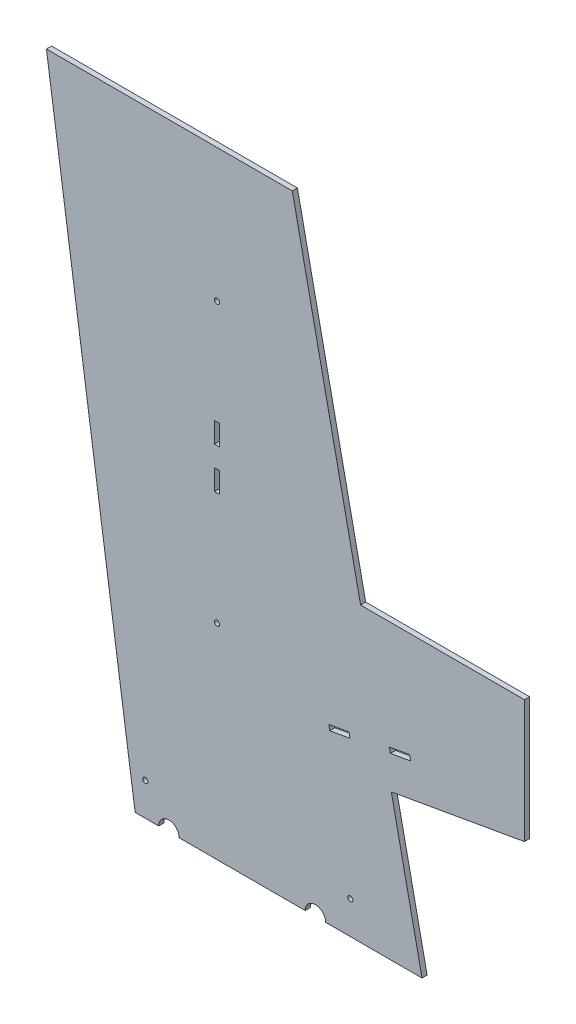
ISO-10303-21;
HEADER;
FILE_DESCRIPTION(('STEP AP214'),'2;1');
FILE_NAME('part.step','',(''),(''),'','','');
FILE_SCHEMA(('AUTOMOTIVE_DESIGN { 1 0 10303 214 1 1 1 1 }'));
ENDSEC;
DATA;
#1=APPLICATION_CONTEXT('core data for automotive mechanical design processes');
#2=APPLICATION_PROTOCOL_DEFINITION('international standard','automotive_design',2000,#1);
#3=PRODUCT_CONTEXT('',#1,'mechanical');
#4=PRODUCT('Part','Part','',(#3));
#5=PRODUCT_RELATED_PRODUCT_CATEGORY('part','',(#4));
#6=PRODUCT_DEFINITION_FORMATION('','',#4);
#7=PRODUCT_DEFINITION_CONTEXT('part definition',#1,'design');
#8=PRODUCT_DEFINITION('design','',#6,#7);
#9=PRODUCT_DEFINITION_SHAPE('','',#8);
#10=(LENGTH_UNIT() NAMED_UNIT(*) SI_UNIT(.MILLI.,.METRE.));
#11=(NAMED_UNIT(*) PLANE_ANGLE_UNIT() SI_UNIT($,.RADIAN.));
#12=(NAMED_UNIT(*) SI_UNIT($,.STERADIAN.) SOLID_ANGLE_UNIT());
#13=UNCERTAINTY_MEASURE_WITH_UNIT(LENGTH_MEASURE(1.E-05),#10,'distance_accuracy_value','');
#14=(GEOMETRIC_REPRESENTATION_CONTEXT(3) GLOBAL_UNCERTAINTY_ASSIGNED_CONTEXT((#13)) GLOBAL_UNIT_ASSIGNED_CONTEXT((#10,
#11,#12)) REPRESENTATION_CONTEXT('',''));
#15=CARTESIAN_POINT('',(0.,0.,0.));
#16=DIRECTION('',(0.,0.,1.));
#17=DIRECTION('',(1.,0.,0.));
#18=AXIS2_PLACEMENT_3D('',#15,#16,#17);
#19=CARTESIAN_POINT('',(0.,0.,3.175));
#20=DIRECTION('',(0.,1.,0.));
#21=DIRECTION('',(-1.,0.,0.));
#22=AXIS2_PLACEMENT_3D('',#19,#20,#21);
#23=PLANE('',#22);
#24=DIRECTION('',(1.,0.,0.));
#25=VECTOR('',#24,1.);
#26=CARTESIAN_POINT('',(0.,0.,3.175));
#27=LINE('',#26,#25);
#28=CARTESIAN_POINT('',(-150.495,0.,3.175));
#29=VERTEX_POINT('',#28);
#30=CARTESIAN_POINT('',(-72.39,0.,3.175));
#31=VERTEX_POINT('',#30);
#32=EDGE_CURVE('E270',#29,#31,#27,.T.);
#33=ORIENTED_EDGE('',*,*,#32,.F.);
#34=DIRECTION('',(0.,0.,-1.));
#35=VECTOR('',#34,1.);
#36=CARTESIAN_POINT('',(-150.495,0.,5.08));
#37=LINE('',#36,#35);
#38=CARTESIAN_POINT('',(-150.495,0.,0.));
#39=VERTEX_POINT('',#38);
#40=EDGE_CURVE('E299',#29,#39,#37,.T.);
#41=ORIENTED_EDGE('',*,*,#40,.T.);
#42=DIRECTION('',(1.,0.,0.));
#43=VECTOR('',#42,1.);
#44=CARTESIAN_POINT('',(0.,0.,0.));
#45=LINE('',#44,#43);
#46=CARTESIAN_POINT('',(-72.39,0.,0.));
#47=VERTEX_POINT('',#46);
#48=EDGE_CURVE('E240',#39,#47,#45,.T.);
#49=ORIENTED_EDGE('',*,*,#48,.T.);
#50=DIRECTION('',(0.,0.,-1.));
#51=VECTOR('',#50,1.);
#52=CARTESIAN_POINT('',(-72.39,0.,5.08));
#53=LINE('',#52,#51);
#54=EDGE_CURVE('E48',#47,#31,#53,.F.);
#55=ORIENTED_EDGE('',*,*,#54,.T.);
#56=EDGE_LOOP('',(#33,#41,#49,#55));
#57=FACE_BOUND('',#56,.T.);
#58=ADVANCED_FACE('F33',(#57),#23,.F.);
#59=CARTESIAN_POINT('',(-59.69,0.,3.175));
#60=VERTEX_POINT('',#59);
#61=CARTESIAN_POINT('',(0.,0.,3.175));
#62=VERTEX_POINT('',#61);
#63=EDGE_CURVE('E231',#60,#62,#27,.T.);
#64=ORIENTED_EDGE('',*,*,#63,.F.);
#65=DIRECTION('',(0.,0.,-1.));
#66=VECTOR('',#65,1.);
#67=CARTESIAN_POINT('',(-59.69,0.,5.08));
#68=LINE('',#67,#66);
#69=CARTESIAN_POINT('',(-59.69,0.,0.));
#70=VERTEX_POINT('',#69);
#71=EDGE_CURVE('E217',#60,#70,#68,.T.);
#72=ORIENTED_EDGE('',*,*,#71,.T.);
#73=CARTESIAN_POINT('',(0.,0.,0.));
#74=VERTEX_POINT('',#73);
#75=EDGE_CURVE('E229',#70,#74,#45,.T.);
#76=ORIENTED_EDGE('',*,*,#75,.T.);
#77=DIRECTION('',(0.,0.,-1.));
#78=VECTOR('',#77,1.);
#79=CARTESIAN_POINT('',(0.,0.,3.175));
#80=LINE('',#79,#78);
#81=EDGE_CURVE('E269',#62,#74,#80,.T.);
#82=ORIENTED_EDGE('',*,*,#81,.F.);
#83=EDGE_LOOP('',(#64,#72,#76,#82));
#84=FACE_BOUND('',#83,.T.);
#85=ADVANCED_FACE('F227',(#84),#23,.F.);
#86=CARTESIAN_POINT('',(-80.3656,382.27,3.175));
#87=DIRECTION('',(-0.978607698485662,-0.205735199867684,0.));
#88=DIRECTION('',(0.205735199867684,-0.978607698485662,0.));
#89=AXIS2_PLACEMENT_3D('',#86,#87,#88);
#90=PLANE('',#89);
#91=DIRECTION('',(-0.205735199867683,0.978607698485662,0.));
#92=VECTOR('',#91,1.);
#93=CARTESIAN_POINT('',(-80.3656,382.27,3.175));
#94=LINE('',#93,#92);
#95=CARTESIAN_POINT('',(-38.0822669770181,181.143526549975,3.175));
#96=VERTEX_POINT('',#95);
#97=CARTESIAN_POINT('',(-80.3656,382.27,3.175));
#98=VERTEX_POINT('',#97);
#99=EDGE_CURVE('E248',#96,#98,#94,.T.);
#100=ORIENTED_EDGE('',*,*,#99,.F.);
#101=DIRECTION('',(0.,0.,-1.));
#102=VECTOR('',#101,1.);
#103=CARTESIAN_POINT('',(-38.0822669770181,181.143526549975,3.175));
#104=LINE('',#103,#102);
#105=CARTESIAN_POINT('',(-38.0822669770181,181.143526549975,0.));
#106=VERTEX_POINT('',#105);
#107=EDGE_CURVE('E439',#96,#106,#104,.T.);
#108=ORIENTED_EDGE('',*,*,#107,.T.);
#109=DIRECTION('',(-0.205735199867683,0.978607698485662,0.));
#110=VECTOR('',#109,1.);
#111=CARTESIAN_POINT('',(-80.3656,382.27,0.));
#112=LINE('',#111,#110);
#113=CARTESIAN_POINT('',(-80.3656,382.27,0.));
#114=VERTEX_POINT('',#113);
#115=EDGE_CURVE('E272',#106,#114,#112,.T.);
#116=ORIENTED_EDGE('',*,*,#115,.T.);
#117=DIRECTION('',(0.,0.,-1.));
#118=VECTOR('',#117,1.);
#119=CARTESIAN_POINT('',(-80.3656,382.27,3.175));
#120=LINE('',#119,#118);
#121=EDGE_CURVE('E282',#98,#114,#120,.T.);
#122=ORIENTED_EDGE('',*,*,#121,.F.);
#123=EDGE_LOOP('',(#100,#108,#116,#122));
#124=FACE_BOUND('',#123,.T.);
#125=ADVANCED_FACE('F474',(#124),#90,.F.);
#126=CARTESIAN_POINT('',(-19.004144454778,90.395819862329,0.));
#127=VERTEX_POINT('',#126);
#128=EDGE_CURVE('E239',#74,#127,#112,.T.);
#129=ORIENTED_EDGE('',*,*,#128,.T.);
#130=DIRECTION('',(0.,0.,1.));
#131=VECTOR('',#130,1.);
#132=CARTESIAN_POINT('',(-19.004144454778,90.3958198623291,3.175));
#133=LINE('',#132,#131);
#134=CARTESIAN_POINT('',(-19.004144454778,90.395819862329,3.175));
#135=VERTEX_POINT('',#134);
#136=EDGE_CURVE('E434',#127,#135,#133,.T.);
#137=ORIENTED_EDGE('',*,*,#136,.T.);
#138=EDGE_CURVE('E252',#62,#135,#94,.T.);
#139=ORIENTED_EDGE('',*,*,#138,.F.);
#140=ORIENTED_EDGE('',*,*,#81,.T.);
#141=EDGE_LOOP('',(#129,#137,#139,#140));
#142=FACE_BOUND('',#141,.T.);
#143=ADVANCED_FACE('F35',(#142),#90,.F.);
#144=CARTESIAN_POINT('',(-232.7656,382.27,3.175));
#145=DIRECTION('',(0.,-1.,0.));
#146=DIRECTION('',(1.,0.,0.));
#147=AXIS2_PLACEMENT_3D('',#144,#145,#146);
#148=PLANE('',#147);
#149=DIRECTION('',(-1.,0.,0.));
#150=VECTOR('',#149,1.);
#151=CARTESIAN_POINT('',(-232.7656,382.27,0.));
#152=LINE('',#151,#150);
#153=CARTESIAN_POINT('',(-232.7656,382.27,0.));
#154=VERTEX_POINT('',#153);
#155=EDGE_CURVE('E244',#114,#154,#152,.T.);
#156=ORIENTED_EDGE('',*,*,#155,.T.);
#157=DIRECTION('',(0.,0.,-1.));
#158=VECTOR('',#157,1.);
#159=CARTESIAN_POINT('',(-232.7656,382.27,3.175));
#160=LINE('',#159,#158);
#161=CARTESIAN_POINT('',(-232.7656,382.27,3.175));
#162=VERTEX_POINT('',#161);
#163=EDGE_CURVE('E279',#162,#154,#160,.T.);
#164=ORIENTED_EDGE('',*,*,#163,.F.);
#165=DIRECTION('',(-1.,0.,0.));
#166=VECTOR('',#165,1.);
#167=CARTESIAN_POINT('',(-232.7656,382.27,3.175));
#168=LINE('',#167,#166);
#169=EDGE_CURVE('E258',#98,#162,#168,.T.);
#170=ORIENTED_EDGE('',*,*,#169,.F.);
#171=ORIENTED_EDGE('',*,*,#121,.T.);
#172=EDGE_LOOP('',(#156,#164,#170,#171));
#173=FACE_BOUND('',#172,.T.);
#174=ADVANCED_FACE('F278',(#173),#148,.F.);
#175=CARTESIAN_POINT('',(-177.8,0.,3.175));
#176=DIRECTION('',(0.989820175598573,0.142323645182413,0.));
#177=DIRECTION('',(-0.142323645182413,0.989820175598573,0.));
#178=AXIS2_PLACEMENT_3D('',#175,#176,#177);
#179=PLANE('',#178);
#180=DIRECTION('',(0.142323645182413,-0.989820175598573,0.));
#181=VECTOR('',#180,1.);
#182=CARTESIAN_POINT('',(-177.8,0.,0.));
#183=LINE('',#182,#181);
#184=CARTESIAN_POINT('',(-177.8,0.,0.));
#185=VERTEX_POINT('',#184);
#186=EDGE_CURVE('E241',#154,#185,#183,.T.);
#187=ORIENTED_EDGE('',*,*,#186,.T.);
#188=DIRECTION('',(0.,0.,-1.));
#189=VECTOR('',#188,1.);
#190=CARTESIAN_POINT('',(-177.8,0.,3.175));
#191=LINE('',#190,#189);
#192=CARTESIAN_POINT('',(-177.8,0.,3.175));
#193=VERTEX_POINT('',#192);
#194=EDGE_CURVE('E288',#193,#185,#191,.T.);
#195=ORIENTED_EDGE('',*,*,#194,.F.);
#196=DIRECTION('',(0.142323645182413,-0.989820175598573,0.));
#197=VECTOR('',#196,1.);
#198=CARTESIAN_POINT('',(-177.8,0.,3.175));
#199=LINE('',#198,#197);
#200=EDGE_CURVE('E264',#162,#193,#199,.T.);
#201=ORIENTED_EDGE('',*,*,#200,.F.);
#202=ORIENTED_EDGE('',*,*,#163,.T.);
#203=EDGE_LOOP('',(#187,#195,#201,#202));
#204=FACE_BOUND('',#203,.T.);
#205=ADVANCED_FACE('F286',(#204),#179,.F.);
#206=CARTESIAN_POINT('',(-163.195,0.,0.));
#207=VERTEX_POINT('',#206);
#208=EDGE_CURVE('E243',#185,#207,#45,.T.);
#209=ORIENTED_EDGE('',*,*,#208,.T.);
#210=DIRECTION('',(0.,0.,-1.));
#211=VECTOR('',#210,1.);
#212=CARTESIAN_POINT('',(-163.195,0.,5.08));
#213=LINE('',#212,#211);
#214=CARTESIAN_POINT('',(-163.195,0.,3.175));
#215=VERTEX_POINT('',#214);
#216=EDGE_CURVE('E56',#207,#215,#213,.F.);
#217=ORIENTED_EDGE('',*,*,#216,.T.);
#218=EDGE_CURVE('E266',#193,#215,#27,.T.);
#219=ORIENTED_EDGE('',*,*,#218,.F.);
#220=ORIENTED_EDGE('',*,*,#194,.T.);
#221=EDGE_LOOP('',(#209,#217,#219,#220));
#222=FACE_BOUND('',#221,.T.);
#223=ADVANCED_FACE('F458',(#222),#23,.F.);
#224=CARTESIAN_POINT('',(0.,0.,3.175));
#225=DIRECTION('',(0.,0.,-1.));
#226=DIRECTION('',(-1.,0.,0.));
#227=AXIS2_PLACEMENT_3D('',#224,#225,#226);
#228=PLANE('',#227);
#229=CARTESIAN_POINT('',(-171.45,20.32,3.175));
#230=DIRECTION('',(0.,0.,-1.));
#231=DIRECTION('',(-1.,0.,0.));
#232=AXIS2_PLACEMENT_3D('',#229,#230,#231);
#233=CIRCLE('',#232,1.58749999999999);
#234=CARTESIAN_POINT('',(-173.0375,20.32,3.175));
#235=VERTEX_POINT('',#234);
#236=EDGE_CURVE('E310',#235,#235,#233,.T.);
#237=ORIENTED_EDGE('',*,*,#236,.T.);
#238=EDGE_LOOP('',(#237));
#239=FACE_BOUND('',#238,.T.);
#240=CARTESIAN_POINT('',(-44.45,20.32,3.175));
#241=DIRECTION('',(0.,0.,-1.));
#242=DIRECTION('',(-1.,0.,0.));
#243=AXIS2_PLACEMENT_3D('',#240,#241,#242);
#244=CIRCLE('',#243,1.5875);
#245=CARTESIAN_POINT('',(-46.0375,20.32,3.175));
#246=VERTEX_POINT('',#245);
#247=EDGE_CURVE('E305',#246,#246,#244,.T.);
#248=ORIENTED_EDGE('',*,*,#247,.T.);
#249=EDGE_LOOP('',(#248));
#250=FACE_BOUND('',#249,.T.);
#251=DIRECTION('',(-1.,0.,0.));
#252=VECTOR('',#251,1.);
#253=CARTESIAN_POINT('',(2.77555756156289E-13,234.95,3.175));
#254=LINE('',#253,#252);
#255=CARTESIAN_POINT('',(-125.4125,234.95,3.175));
#256=VERTEX_POINT('',#255);
#257=CARTESIAN_POINT('',(-128.5875,234.95,3.175));
#258=VERTEX_POINT('',#257);
#259=EDGE_CURVE('E315',#256,#258,#254,.T.);
#260=ORIENTED_EDGE('',*,*,#259,.F.);
#261=DIRECTION('',(0.,1.,0.));
#262=VECTOR('',#261,1.);
#263=CARTESIAN_POINT('',(-125.4125,25.4,3.175));
#264=LINE('',#263,#262);
#265=CARTESIAN_POINT('',(-125.4125,222.25,3.175));
#266=VERTEX_POINT('',#265);
#267=EDGE_CURVE('E313',#266,#256,#264,.T.);
#268=ORIENTED_EDGE('',*,*,#267,.F.);
#269=DIRECTION('',(1.,0.,0.));
#270=VECTOR('',#269,1.);
#271=CARTESIAN_POINT('',(2.77555756156289E-13,222.25,3.175));
#272=LINE('',#271,#270);
#273=CARTESIAN_POINT('',(-128.5875,222.25,3.175));
#274=VERTEX_POINT('',#273);
#275=EDGE_CURVE('E321',#274,#266,#272,.T.);
#276=ORIENTED_EDGE('',*,*,#275,.F.);
#277=DIRECTION('',(0.,-1.,0.));
#278=VECTOR('',#277,1.);
#279=CARTESIAN_POINT('',(-128.587500000002,25.4000000000014,3.175));
#280=LINE('',#279,#278);
#281=EDGE_CURVE('E318',#258,#274,#280,.T.);
#282=ORIENTED_EDGE('',*,*,#281,.F.);
#283=EDGE_LOOP('',(#260,#268,#276,#282));
#284=FACE_BOUND('',#283,.T.);
#285=DIRECTION('',(-1.,0.,0.));
#286=VECTOR('',#285,1.);
#287=CARTESIAN_POINT('',(0.,209.55,3.175));
#288=LINE('',#287,#286);
#289=CARTESIAN_POINT('',(-125.4125,209.55,3.175));
#290=VERTEX_POINT('',#289);
#291=CARTESIAN_POINT('',(-128.5875,209.55,3.175));
#292=VERTEX_POINT('',#291);
#293=EDGE_CURVE('E335',#290,#292,#288,.T.);
#294=ORIENTED_EDGE('',*,*,#293,.F.);
#295=DIRECTION('',(0.,1.,0.));
#296=VECTOR('',#295,1.);
#297=CARTESIAN_POINT('',(-125.4125,0.,3.175));
#298=LINE('',#297,#296);
#299=CARTESIAN_POINT('',(-125.4125,196.85,3.175));
#300=VERTEX_POINT('',#299);
#301=EDGE_CURVE('E327',#300,#290,#298,.T.);
#302=ORIENTED_EDGE('',*,*,#301,.F.);
#303=DIRECTION('',(1.,0.,0.));
#304=VECTOR('',#303,1.);
#305=CARTESIAN_POINT('',(0.,196.85,3.175));
#306=LINE('',#305,#304);
#307=CARTESIAN_POINT('',(-128.5875,196.85,3.175));
#308=VERTEX_POINT('',#307);
#309=EDGE_CURVE('E341',#308,#300,#306,.T.);
#310=ORIENTED_EDGE('',*,*,#309,.F.);
#311=DIRECTION('',(0.,-1.,0.));
#312=VECTOR('',#311,1.);
#313=CARTESIAN_POINT('',(-128.587500000002,1.40512601554124E-12,3.175));
#314=LINE('',#313,#312);
#315=EDGE_CURVE('E338',#292,#308,#314,.T.);
#316=ORIENTED_EDGE('',*,*,#315,.F.);
#317=EDGE_LOOP('',(#294,#302,#310,#316));
#318=FACE_BOUND('',#317,.T.);
#319=DIRECTION('',(0.984807753012208,0.173648177666931,0.));
#320=VECTOR('',#319,1.);
#321=CARTESIAN_POINT('',(-57.15,104.14,3.175));
#322=LINE('',#321,#320);
#323=CARTESIAN_POINT('',(-57.15,104.14,3.175));
#324=VERTEX_POINT('',#323);
#325=CARTESIAN_POINT('',(-44.642941536745,106.34533185637,3.175));
#326=VERTEX_POINT('',#325);
#327=EDGE_CURVE('E370',#324,#326,#322,.T.);
#328=ORIENTED_EDGE('',*,*,#327,.F.);
#329=DIRECTION('',(0.173648177666936,-0.984807753012207,0.));
#330=VECTOR('',#329,1.);
#331=CARTESIAN_POINT('',(-57.7013329640926,107.266764615814,3.175));
#332=LINE('',#331,#330);
#333=CARTESIAN_POINT('',(-57.7013329640926,107.266764615814,3.175));
#334=VERTEX_POINT('',#333);
#335=EDGE_CURVE('E368',#334,#324,#332,.T.);
#336=ORIENTED_EDGE('',*,*,#335,.F.);
#337=DIRECTION('',(-0.984807753012208,-0.173648177666931,0.));
#338=VECTOR('',#337,1.);
#339=CARTESIAN_POINT('',(-45.1942745008375,109.472096472184,3.175));
#340=LINE('',#339,#338);
#341=CARTESIAN_POINT('',(-45.1942745008375,109.472096472184,3.175));
#342=VERTEX_POINT('',#341);
#343=EDGE_CURVE('E358',#342,#334,#340,.T.);
#344=ORIENTED_EDGE('',*,*,#343,.F.);
#345=DIRECTION('',(-0.173648177666932,0.984807753012208,0.));
#346=VECTOR('',#345,1.);
#347=CARTESIAN_POINT('',(-45.1942745008375,109.472096472184,3.175));
#348=LINE('',#347,#346);
#349=EDGE_CURVE('E374',#326,#342,#348,.T.);
#350=ORIENTED_EDGE('',*,*,#349,.F.);
#351=EDGE_LOOP('',(#328,#336,#344,#350));
#352=FACE_BOUND('',#351,.T.);
#353=DIRECTION('',(0.984807753012208,0.173648177666932,0.));
#354=VECTOR('',#353,1.);
#355=CARTESIAN_POINT('',(-19.6288246102349,110.75599556911,3.175));
#356=LINE('',#355,#354);
#357=CARTESIAN_POINT('',(-19.6288246102349,110.75599556911,3.175));
#358=VERTEX_POINT('',#357);
#359=CARTESIAN_POINT('',(-7.12176614697988,112.96132742548,3.175));
#360=VERTEX_POINT('',#359);
#361=EDGE_CURVE('E403',#358,#360,#356,.T.);
#362=ORIENTED_EDGE('',*,*,#361,.F.);
#363=DIRECTION('',(0.173648177666931,-0.984807753012208,0.));
#364=VECTOR('',#363,1.);
#365=CARTESIAN_POINT('',(-20.1801575743274,113.882760184924,3.175));
#366=LINE('',#365,#364);
#367=CARTESIAN_POINT('',(-20.1801575743274,113.882760184924,3.175));
#368=VERTEX_POINT('',#367);
#369=EDGE_CURVE('E347',#368,#358,#366,.T.);
#370=ORIENTED_EDGE('',*,*,#369,.F.);
#371=DIRECTION('',(-0.984807753012208,-0.173648177666931,0.));
#372=VECTOR('',#371,1.);
#373=CARTESIAN_POINT('',(-7.67309911107239,116.088092041294,3.175));
#374=LINE('',#373,#372);
#375=CARTESIAN_POINT('',(-7.67309911107239,116.088092041294,3.175));
#376=VERTEX_POINT('',#375);
#377=EDGE_CURVE('E392',#376,#368,#374,.T.);
#378=ORIENTED_EDGE('',*,*,#377,.F.);
#379=DIRECTION('',(-0.173648177666933,0.984807753012208,0.));
#380=VECTOR('',#379,1.);
#381=CARTESIAN_POINT('',(-7.67309911107239,116.088092041294,3.175));
#382=LINE('',#381,#380);
#383=EDGE_CURVE('E406',#360,#376,#382,.T.);
#384=ORIENTED_EDGE('',*,*,#383,.F.);
#385=EDGE_LOOP('',(#362,#370,#378,#384));
#386=FACE_BOUND('',#385,.T.);
#387=ORIENTED_EDGE('',*,*,#218,.T.);
#388=CARTESIAN_POINT('',(-156.845,0.,3.175));
#389=DIRECTION('',(0.,0.,-1.));
#390=DIRECTION('',(-1.,0.,0.));
#391=AXIS2_PLACEMENT_3D('',#388,#389,#390);
#392=CIRCLE('',#391,6.35);
#393=EDGE_CURVE('E232',#215,#29,#392,.T.);
#394=ORIENTED_EDGE('',*,*,#393,.T.);
#395=ORIENTED_EDGE('',*,*,#32,.T.);
#396=CARTESIAN_POINT('',(-66.04,0.,3.175));
#397=DIRECTION('',(0.,0.,-1.));
#398=DIRECTION('',(-1.,0.,0.));
#399=AXIS2_PLACEMENT_3D('',#396,#397,#398);
#400=CIRCLE('',#399,6.35);
#401=EDGE_CURVE('E291',#31,#60,#400,.T.);
#402=ORIENTED_EDGE('',*,*,#401,.T.);
#403=ORIENTED_EDGE('',*,*,#63,.T.);
#404=ORIENTED_EDGE('',*,*,#138,.T.);
#405=DIRECTION('',(0.984807753012208,0.173648177666931,0.));
#406=VECTOR('',#405,1.);
#407=CARTESIAN_POINT('',(-63.5,82.55,3.175));
#408=LINE('',#407,#406);
#409=CARTESIAN_POINT('',(63.5,104.943526549975,3.175));
#410=VERTEX_POINT('',#409);
#411=EDGE_CURVE('E381',#135,#410,#408,.T.);
#412=ORIENTED_EDGE('',*,*,#411,.T.);
#413=DIRECTION('',(0.,1.,0.));
#414=VECTOR('',#413,1.);
#415=CARTESIAN_POINT('',(63.5,104.943526549975,3.175));
#416=LINE('',#415,#414);
#417=CARTESIAN_POINT('',(63.5,181.143526549975,3.175));
#418=VERTEX_POINT('',#417);
#419=EDGE_CURVE('E428',#410,#418,#416,.T.);
#420=ORIENTED_EDGE('',*,*,#419,.T.);
#421=DIRECTION('',(-1.,0.,0.));
#422=VECTOR('',#421,1.);
#423=CARTESIAN_POINT('',(-63.5,181.143526549975,3.175));
#424=LINE('',#423,#422);
#425=EDGE_CURVE('E421',#418,#96,#424,.T.);
#426=ORIENTED_EDGE('',*,*,#425,.T.);
#427=ORIENTED_EDGE('',*,*,#99,.T.);
#428=ORIENTED_EDGE('',*,*,#169,.T.);
#429=ORIENTED_EDGE('',*,*,#200,.T.);
#430=EDGE_LOOP('',(#387,#394,#395,#402,#403,#404,#412,#420,#426,#427,#428,#429));
#431=FACE_BOUND('',#430,.T.);
#432=CARTESIAN_POINT('',(-127.,127.,3.175));
#433=DIRECTION('',(0.,0.,1.));
#434=DIRECTION('',(1.,0.,0.));
#435=AXIS2_PLACEMENT_3D('',#432,#433,#434);
#436=CIRCLE('',#435,1.58749999999999);
#437=CARTESIAN_POINT('',(-125.4125,127.,3.175));
#438=VERTEX_POINT('',#437);
#439=EDGE_CURVE('E445',#438,#438,#436,.T.);
#440=ORIENTED_EDGE('',*,*,#439,.F.);
#441=EDGE_LOOP('',(#440));
#442=FACE_BOUND('',#441,.T.);
#443=CARTESIAN_POINT('',(-127.,299.72,3.175));
#444=DIRECTION('',(0.,0.,1.));
#445=DIRECTION('',(1.,0.,0.));
#446=AXIS2_PLACEMENT_3D('',#443,#444,#445);
#447=CIRCLE('',#446,1.58749999999999);
#448=CARTESIAN_POINT('',(-125.4125,299.72,3.175));
#449=VERTEX_POINT('',#448);
#450=EDGE_CURVE('E261',#449,#449,#447,.T.);
#451=ORIENTED_EDGE('',*,*,#450,.F.);
#452=EDGE_LOOP('',(#451));
#453=FACE_BOUND('',#452,.T.);
#454=ADVANCED_FACE('F456',(#239,#250,#284,#318,#352,#386,#431,#442,#453),#228,.F.);
#455=CARTESIAN_POINT('',(0.,0.,0.));
#456=DIRECTION('',(0.,0.,-1.));
#457=DIRECTION('',(-1.,0.,0.));
#458=AXIS2_PLACEMENT_3D('',#455,#456,#457);
#459=PLANE('',#458);
#460=CARTESIAN_POINT('',(-156.845,0.,0.));
#461=DIRECTION('',(0.,0.,-1.));
#462=DIRECTION('',(-1.,0.,0.));
#463=AXIS2_PLACEMENT_3D('',#460,#461,#462);
#464=CIRCLE('',#463,6.35);
#465=EDGE_CURVE('E223',#207,#39,#464,.T.);
#466=ORIENTED_EDGE('',*,*,#465,.F.);
#467=ORIENTED_EDGE('',*,*,#208,.F.);
#468=ORIENTED_EDGE('',*,*,#186,.F.);
#469=ORIENTED_EDGE('',*,*,#155,.F.);
#470=ORIENTED_EDGE('',*,*,#115,.F.);
#471=DIRECTION('',(-1.,0.,0.));
#472=VECTOR('',#471,1.);
#473=CARTESIAN_POINT('',(-63.5,181.143526549975,0.));
#474=LINE('',#473,#472);
#475=CARTESIAN_POINT('',(63.5,181.143526549975,0.));
#476=VERTEX_POINT('',#475);
#477=EDGE_CURVE('E424',#476,#106,#474,.T.);
#478=ORIENTED_EDGE('',*,*,#477,.F.);
#479=DIRECTION('',(0.,1.,0.));
#480=VECTOR('',#479,1.);
#481=CARTESIAN_POINT('',(63.5,104.943526549975,0.));
#482=LINE('',#481,#480);
#483=CARTESIAN_POINT('',(63.5,104.943526549975,0.));
#484=VERTEX_POINT('',#483);
#485=EDGE_CURVE('E420',#484,#476,#482,.T.);
#486=ORIENTED_EDGE('',*,*,#485,.F.);
#487=DIRECTION('',(0.984807753012208,0.173648177666931,0.));
#488=VECTOR('',#487,1.);
#489=CARTESIAN_POINT('',(-63.5,82.55,0.));
#490=LINE('',#489,#488);
#491=EDGE_CURVE('E418',#127,#484,#490,.T.);
#492=ORIENTED_EDGE('',*,*,#491,.F.);
#493=ORIENTED_EDGE('',*,*,#128,.F.);
#494=ORIENTED_EDGE('',*,*,#75,.F.);
#495=CARTESIAN_POINT('',(-66.04,0.,0.));
#496=DIRECTION('',(0.,0.,-1.));
#497=DIRECTION('',(-1.,0.,0.));
#498=AXIS2_PLACEMENT_3D('',#495,#496,#497);
#499=CIRCLE('',#498,6.35);
#500=EDGE_CURVE('E214',#47,#70,#499,.T.);
#501=ORIENTED_EDGE('',*,*,#500,.F.);
#502=ORIENTED_EDGE('',*,*,#48,.F.);
#503=EDGE_LOOP('',(#466,#467,#468,#469,#470,#478,#486,#492,#493,#494,#501,#502));
#504=FACE_BOUND('',#503,.T.);
#505=CARTESIAN_POINT('',(-171.45,20.32,0.));
#506=DIRECTION('',(0.,0.,-1.));
#507=DIRECTION('',(-1.,0.,0.));
#508=AXIS2_PLACEMENT_3D('',#505,#506,#507);
#509=CIRCLE('',#508,1.58749999999999);
#510=CARTESIAN_POINT('',(-173.0375,20.32,0.));
#511=VERTEX_POINT('',#510);
#512=EDGE_CURVE('E302',#511,#511,#509,.T.);
#513=ORIENTED_EDGE('',*,*,#512,.F.);
#514=EDGE_LOOP('',(#513));
#515=FACE_BOUND('',#514,.T.);
#516=CARTESIAN_POINT('',(-44.45,20.32,0.));
#517=DIRECTION('',(0.,0.,-1.));
#518=DIRECTION('',(-1.,0.,0.));
#519=AXIS2_PLACEMENT_3D('',#516,#517,#518);
#520=CIRCLE('',#519,1.5875);
#521=CARTESIAN_POINT('',(-46.0375,20.32,0.));
#522=VERTEX_POINT('',#521);
#523=EDGE_CURVE('E301',#522,#522,#520,.T.);
#524=ORIENTED_EDGE('',*,*,#523,.F.);
#525=EDGE_LOOP('',(#524));
#526=FACE_BOUND('',#525,.T.);
#527=DIRECTION('',(0.,-1.,0.));
#528=VECTOR('',#527,1.);
#529=CARTESIAN_POINT('',(-125.4125,0.,0.));
#530=LINE('',#529,#528);
#531=CARTESIAN_POINT('',(-125.4125,234.95,0.));
#532=VERTEX_POINT('',#531);
#533=CARTESIAN_POINT('',(-125.4125,222.25,0.));
#534=VERTEX_POINT('',#533);
#535=EDGE_CURVE('E11',#532,#534,#530,.T.);
#536=ORIENTED_EDGE('',*,*,#535,.F.);
#537=DIRECTION('',(1.,0.,0.));
#538=VECTOR('',#537,1.);
#539=CARTESIAN_POINT('',(0.,234.95,0.));
#540=LINE('',#539,#538);
#541=CARTESIAN_POINT('',(-128.5875,234.95,0.));
#542=VERTEX_POINT('',#541);
#543=EDGE_CURVE('E500',#542,#532,#540,.T.);
#544=ORIENTED_EDGE('',*,*,#543,.F.);
#545=DIRECTION('',(0.,1.,0.));
#546=VECTOR('',#545,1.);
#547=CARTESIAN_POINT('',(-128.587500000002,1.40512601554124E-12,0.));
#548=LINE('',#547,#546);
#549=CARTESIAN_POINT('',(-128.5875,222.25,0.));
#550=VERTEX_POINT('',#549);
#551=EDGE_CURVE('E502',#550,#542,#548,.T.);
#552=ORIENTED_EDGE('',*,*,#551,.F.);
#553=DIRECTION('',(-1.,0.,0.));
#554=VECTOR('',#553,1.);
#555=CARTESIAN_POINT('',(0.,222.25,0.));
#556=LINE('',#555,#554);
#557=EDGE_CURVE('E41',#534,#550,#556,.T.);
#558=ORIENTED_EDGE('',*,*,#557,.F.);
#559=EDGE_LOOP('',(#536,#544,#552,#558));
#560=FACE_BOUND('',#559,.T.);
#561=DIRECTION('',(0.,-1.,0.));
#562=VECTOR('',#561,1.);
#563=CARTESIAN_POINT('',(-125.4125,0.,0.));
#564=LINE('',#563,#562);
#565=CARTESIAN_POINT('',(-125.4125,209.55,0.));
#566=VERTEX_POINT('',#565);
#567=CARTESIAN_POINT('',(-125.4125,196.85,0.));
#568=VERTEX_POINT('',#567);
#569=EDGE_CURVE('E498',#566,#568,#564,.T.);
#570=ORIENTED_EDGE('',*,*,#569,.F.);
#571=DIRECTION('',(1.,0.,0.));
#572=VECTOR('',#571,1.);
#573=CARTESIAN_POINT('',(0.,209.55,0.));
#574=LINE('',#573,#572);
#575=CARTESIAN_POINT('',(-128.5875,209.55,0.));
#576=VERTEX_POINT('',#575);
#577=EDGE_CURVE('E491',#576,#566,#574,.T.);
#578=ORIENTED_EDGE('',*,*,#577,.F.);
#579=DIRECTION('',(0.,1.,0.));
#580=VECTOR('',#579,1.);
#581=CARTESIAN_POINT('',(-128.587500000002,1.40512601554124E-12,0.));
#582=LINE('',#581,#580);
#583=CARTESIAN_POINT('',(-128.5875,196.85,0.));
#584=VERTEX_POINT('',#583);
#585=EDGE_CURVE('E493',#584,#576,#582,.T.);
#586=ORIENTED_EDGE('',*,*,#585,.F.);
#587=DIRECTION('',(-1.,0.,0.));
#588=VECTOR('',#587,1.);
#589=CARTESIAN_POINT('',(0.,196.85,0.));
#590=LINE('',#589,#588);
#591=EDGE_CURVE('E496',#568,#584,#590,.T.);
#592=ORIENTED_EDGE('',*,*,#591,.F.);
#593=EDGE_LOOP('',(#570,#578,#586,#592));
#594=FACE_BOUND('',#593,.T.);
#595=DIRECTION('',(0.173648177666936,-0.984807753012207,0.));
#596=VECTOR('',#595,1.);
#597=CARTESIAN_POINT('',(-57.7013329640926,107.266764615814,0.));
#598=LINE('',#597,#596);
#599=CARTESIAN_POINT('',(-57.7013329640926,107.266764615814,0.));
#600=VERTEX_POINT('',#599);
#601=CARTESIAN_POINT('',(-57.15,104.14,0.));
#602=VERTEX_POINT('',#601);
#603=EDGE_CURVE('E354',#600,#602,#598,.T.);
#604=ORIENTED_EDGE('',*,*,#603,.T.);
#605=DIRECTION('',(0.984807753012208,0.173648177666931,0.));
#606=VECTOR('',#605,1.);
#607=CARTESIAN_POINT('',(-57.15,104.14,0.));
#608=LINE('',#607,#606);
#609=CARTESIAN_POINT('',(-44.642941536745,106.34533185637,0.));
#610=VERTEX_POINT('',#609);
#611=EDGE_CURVE('E357',#602,#610,#608,.T.);
#612=ORIENTED_EDGE('',*,*,#611,.T.);
#613=DIRECTION('',(-0.173648177666932,0.984807753012208,0.));
#614=VECTOR('',#613,1.);
#615=CARTESIAN_POINT('',(-45.1942745008375,109.472096472184,0.));
#616=LINE('',#615,#614);
#617=CARTESIAN_POINT('',(-45.1942745008375,109.472096472184,0.));
#618=VERTEX_POINT('',#617);
#619=EDGE_CURVE('E361',#610,#618,#616,.T.);
#620=ORIENTED_EDGE('',*,*,#619,.T.);
#621=DIRECTION('',(-0.984807753012208,-0.173648177666931,0.));
#622=VECTOR('',#621,1.);
#623=CARTESIAN_POINT('',(-45.1942745008375,109.472096472184,0.));
#624=LINE('',#623,#622);
#625=EDGE_CURVE('E364',#618,#600,#624,.T.);
#626=ORIENTED_EDGE('',*,*,#625,.T.);
#627=EDGE_LOOP('',(#604,#612,#620,#626));
#628=FACE_BOUND('',#627,.T.);
#629=DIRECTION('',(0.173648177666931,-0.984807753012208,0.));
#630=VECTOR('',#629,1.);
#631=CARTESIAN_POINT('',(-20.1801575743274,113.882760184924,0.));
#632=LINE('',#631,#630);
#633=CARTESIAN_POINT('',(-20.1801575743274,113.882760184924,0.));
#634=VERTEX_POINT('',#633);
#635=CARTESIAN_POINT('',(-19.6288246102349,110.75599556911,0.));
#636=VERTEX_POINT('',#635);
#637=EDGE_CURVE('E388',#634,#636,#632,.T.);
#638=ORIENTED_EDGE('',*,*,#637,.T.);
#639=DIRECTION('',(0.984807753012208,0.173648177666932,0.));
#640=VECTOR('',#639,1.);
#641=CARTESIAN_POINT('',(-19.6288246102349,110.75599556911,0.));
#642=LINE('',#641,#640);
#643=CARTESIAN_POINT('',(-7.12176614697988,112.96132742548,0.));
#644=VERTEX_POINT('',#643);
#645=EDGE_CURVE('E391',#636,#644,#642,.T.);
#646=ORIENTED_EDGE('',*,*,#645,.T.);
#647=DIRECTION('',(-0.173648177666933,0.984807753012208,0.));
#648=VECTOR('',#647,1.);
#649=CARTESIAN_POINT('',(-7.67309911107239,116.088092041294,0.));
#650=LINE('',#649,#648);
#651=CARTESIAN_POINT('',(-7.67309911107239,116.088092041294,0.));
#652=VERTEX_POINT('',#651);
#653=EDGE_CURVE('E395',#644,#652,#650,.T.);
#654=ORIENTED_EDGE('',*,*,#653,.T.);
#655=DIRECTION('',(-0.984807753012208,-0.173648177666931,0.));
#656=VECTOR('',#655,1.);
#657=CARTESIAN_POINT('',(-7.67309911107239,116.088092041294,0.));
#658=LINE('',#657,#656);
#659=EDGE_CURVE('E398',#652,#634,#658,.T.);
#660=ORIENTED_EDGE('',*,*,#659,.T.);
#661=EDGE_LOOP('',(#638,#646,#654,#660));
#662=FACE_BOUND('',#661,.T.);
#663=CARTESIAN_POINT('',(-127.,127.,0.));
#664=DIRECTION('',(0.,0.,1.));
#665=DIRECTION('',(1.,0.,0.));
#666=AXIS2_PLACEMENT_3D('',#663,#664,#665);
#667=CIRCLE('',#666,1.58749999999999);
#668=CARTESIAN_POINT('',(-125.4125,127.,0.));
#669=VERTEX_POINT('',#668);
#670=EDGE_CURVE('E442',#669,#669,#667,.T.);
#671=ORIENTED_EDGE('',*,*,#670,.T.);
#672=EDGE_LOOP('',(#671));
#673=FACE_BOUND('',#672,.T.);
#674=CARTESIAN_POINT('',(-127.,299.72,0.));
#675=DIRECTION('',(0.,0.,1.));
#676=DIRECTION('',(1.,0.,0.));
#677=AXIS2_PLACEMENT_3D('',#674,#675,#676);
#678=CIRCLE('',#677,1.58749999999999);
#679=CARTESIAN_POINT('',(-125.4125,299.72,0.));
#680=VERTEX_POINT('',#679);
#681=EDGE_CURVE('E447',#680,#680,#678,.T.);
#682=ORIENTED_EDGE('',*,*,#681,.T.);
#683=EDGE_LOOP('',(#682));
#684=FACE_BOUND('',#683,.T.);
#685=ADVANCED_FACE('F235',(#504,#515,#526,#560,#594,#628,#662,#673,#684),#459,.T.);
#686=CARTESIAN_POINT('',(-127.,299.72,0.));
#687=DIRECTION('',(0.,0.,1.));
#688=DIRECTION('',(1.,0.,0.));
#689=AXIS2_PLACEMENT_3D('',#686,#687,#688);
#690=CYLINDRICAL_SURFACE('',#689,1.58749999999999);
#691=ORIENTED_EDGE('',*,*,#681,.F.);
#692=EDGE_LOOP('',(#691));
#693=FACE_BOUND('',#692,.T.);
#694=ORIENTED_EDGE('',*,*,#450,.T.);
#695=EDGE_LOOP('',(#694));
#696=FACE_BOUND('',#695,.T.);
#697=ADVANCED_FACE('F454',(#693,#696),#690,.F.);
#698=CARTESIAN_POINT('',(-127.,127.,0.));
#699=DIRECTION('',(0.,0.,1.));
#700=DIRECTION('',(1.,0.,0.));
#701=AXIS2_PLACEMENT_3D('',#698,#699,#700);
#702=CYLINDRICAL_SURFACE('',#701,1.58749999999999);
#703=ORIENTED_EDGE('',*,*,#670,.F.);
#704=EDGE_LOOP('',(#703));
#705=FACE_BOUND('',#704,.T.);
#706=ORIENTED_EDGE('',*,*,#439,.T.);
#707=EDGE_LOOP('',(#706));
#708=FACE_BOUND('',#707,.T.);
#709=ADVANCED_FACE('F542',(#705,#708),#702,.F.);
#710=CARTESIAN_POINT('',(-63.5,181.143526549975,0.));
#711=DIRECTION('',(0.,1.,0.));
#712=DIRECTION('',(0.,0.,1.));
#713=AXIS2_PLACEMENT_3D('',#710,#711,#712);
#714=PLANE('',#713);
#715=ORIENTED_EDGE('',*,*,#107,.F.);
#716=ORIENTED_EDGE('',*,*,#425,.F.);
#717=DIRECTION('',(0.,0.,1.));
#718=VECTOR('',#717,1.);
#719=CARTESIAN_POINT('',(63.5,181.143526549975,0.));
#720=LINE('',#719,#718);
#721=EDGE_CURVE('E432',#476,#418,#720,.T.);
#722=ORIENTED_EDGE('',*,*,#721,.F.);
#723=ORIENTED_EDGE('',*,*,#477,.T.);
#724=EDGE_LOOP('',(#715,#716,#722,#723));
#725=FACE_BOUND('',#724,.T.);
#726=ADVANCED_FACE('F544',(#725),#714,.T.);
#727=CARTESIAN_POINT('',(-63.5,82.55,0.));
#728=DIRECTION('',(0.173648177666931,-0.984807753012208,0.));
#729=DIRECTION('',(0.984807753012208,0.173648177666931,0.));
#730=AXIS2_PLACEMENT_3D('',#727,#728,#729);
#731=PLANE('',#730);
#732=ORIENTED_EDGE('',*,*,#136,.F.);
#733=ORIENTED_EDGE('',*,*,#491,.T.);
#734=DIRECTION('',(0.,0.,1.));
#735=VECTOR('',#734,1.);
#736=CARTESIAN_POINT('',(63.5,104.943526549975,0.));
#737=LINE('',#736,#735);
#738=EDGE_CURVE('E426',#484,#410,#737,.T.);
#739=ORIENTED_EDGE('',*,*,#738,.T.);
#740=ORIENTED_EDGE('',*,*,#411,.F.);
#741=EDGE_LOOP('',(#732,#733,#739,#740));
#742=FACE_BOUND('',#741,.T.);
#743=ADVANCED_FACE('F551',(#742),#731,.T.);
#744=CARTESIAN_POINT('',(63.5,104.943526549975,0.));
#745=DIRECTION('',(1.,0.,0.));
#746=DIRECTION('',(0.,0.,-1.));
#747=AXIS2_PLACEMENT_3D('',#744,#745,#746);
#748=PLANE('',#747);
#749=ORIENTED_EDGE('',*,*,#419,.F.);
#750=ORIENTED_EDGE('',*,*,#738,.F.);
#751=ORIENTED_EDGE('',*,*,#485,.T.);
#752=ORIENTED_EDGE('',*,*,#721,.T.);
#753=EDGE_LOOP('',(#749,#750,#751,#752));
#754=FACE_BOUND('',#753,.T.);
#755=ADVANCED_FACE('F559',(#754),#748,.T.);
#756=CARTESIAN_POINT('',(-20.1801575743274,113.882760184924,0.));
#757=DIRECTION('',(-0.984807753012208,-0.173648177666931,0.));
#758=DIRECTION('',(0.173648177666931,-0.984807753012208,0.));
#759=AXIS2_PLACEMENT_3D('',#756,#757,#758);
#760=PLANE('',#759);
#761=ORIENTED_EDGE('',*,*,#369,.T.);
#762=DIRECTION('',(0.,0.,1.));
#763=VECTOR('',#762,1.);
#764=CARTESIAN_POINT('',(-19.6288246102349,110.75599556911,0.));
#765=LINE('',#764,#763);
#766=EDGE_CURVE('E401',#636,#358,#765,.T.);
#767=ORIENTED_EDGE('',*,*,#766,.F.);
#768=ORIENTED_EDGE('',*,*,#637,.F.);
#769=DIRECTION('',(0.,0.,1.));
#770=VECTOR('',#769,1.);
#771=CARTESIAN_POINT('',(-20.1801575743274,113.882760184924,0.));
#772=LINE('',#771,#770);
#773=EDGE_CURVE('E371',#634,#368,#772,.T.);
#774=ORIENTED_EDGE('',*,*,#773,.T.);
#775=EDGE_LOOP('',(#761,#767,#768,#774));
#776=FACE_BOUND('',#775,.T.);
#777=ADVANCED_FACE('F562',(#776),#760,.F.);
#778=CARTESIAN_POINT('',(-7.67309911107239,116.088092041294,0.));
#779=DIRECTION('',(-0.173648177666931,0.984807753012208,0.));
#780=DIRECTION('',(-0.984807753012208,-0.173648177666931,0.));
#781=AXIS2_PLACEMENT_3D('',#778,#779,#780);
#782=PLANE('',#781);
#783=ORIENTED_EDGE('',*,*,#377,.T.);
#784=ORIENTED_EDGE('',*,*,#773,.F.);
#785=ORIENTED_EDGE('',*,*,#659,.F.);
#786=DIRECTION('',(0.,0.,1.));
#787=VECTOR('',#786,1.);
#788=CARTESIAN_POINT('',(-7.67309911107239,116.088092041294,0.));
#789=LINE('',#788,#787);
#790=EDGE_CURVE('E412',#652,#376,#789,.T.);
#791=ORIENTED_EDGE('',*,*,#790,.T.);
#792=EDGE_LOOP('',(#783,#784,#785,#791));
#793=FACE_BOUND('',#792,.T.);
#794=ADVANCED_FACE('F567',(#793),#782,.F.);
#795=CARTESIAN_POINT('',(-7.67309911107239,116.088092041294,0.));
#796=DIRECTION('',(0.984807753012208,0.173648177666933,0.));
#797=DIRECTION('',(-0.173648177666933,0.984807753012208,0.));
#798=AXIS2_PLACEMENT_3D('',#795,#796,#797);
#799=PLANE('',#798);
#800=ORIENTED_EDGE('',*,*,#383,.T.);
#801=ORIENTED_EDGE('',*,*,#790,.F.);
#802=ORIENTED_EDGE('',*,*,#653,.F.);
#803=DIRECTION('',(0.,0.,1.));
#804=VECTOR('',#803,1.);
#805=CARTESIAN_POINT('',(-7.12176614697988,112.96132742548,0.));
#806=LINE('',#805,#804);
#807=EDGE_CURVE('E414',#644,#360,#806,.T.);
#808=ORIENTED_EDGE('',*,*,#807,.T.);
#809=EDGE_LOOP('',(#800,#801,#802,#808));
#810=FACE_BOUND('',#809,.T.);
#811=ADVANCED_FACE('F573',(#810),#799,.F.);
#812=CARTESIAN_POINT('',(-19.6288246102349,110.75599556911,0.));
#813=DIRECTION('',(0.173648177666932,-0.984807753012208,0.));
#814=DIRECTION('',(0.984807753012208,0.173648177666932,0.));
#815=AXIS2_PLACEMENT_3D('',#812,#813,#814);
#816=PLANE('',#815);
#817=ORIENTED_EDGE('',*,*,#361,.T.);
#818=ORIENTED_EDGE('',*,*,#807,.F.);
#819=ORIENTED_EDGE('',*,*,#645,.F.);
#820=ORIENTED_EDGE('',*,*,#766,.T.);
#821=EDGE_LOOP('',(#817,#818,#819,#820));
#822=FACE_BOUND('',#821,.T.);
#823=ADVANCED_FACE('F569',(#822),#816,.F.);
#824=CARTESIAN_POINT('',(-57.7013329640926,107.266764615814,0.));
#825=DIRECTION('',(-0.984807753012207,-0.173648177666936,0.));
#826=DIRECTION('',(0.173648177666936,-0.984807753012207,0.));
#827=AXIS2_PLACEMENT_3D('',#824,#825,#826);
#828=PLANE('',#827);
#829=ORIENTED_EDGE('',*,*,#335,.T.);
#830=DIRECTION('',(0.,0.,1.));
#831=VECTOR('',#830,1.);
#832=CARTESIAN_POINT('',(-57.15,104.14,0.));
#833=LINE('',#832,#831);
#834=EDGE_CURVE('E367',#602,#324,#833,.T.);
#835=ORIENTED_EDGE('',*,*,#834,.F.);
#836=ORIENTED_EDGE('',*,*,#603,.F.);
#837=DIRECTION('',(0.,0.,1.));
#838=VECTOR('',#837,1.);
#839=CARTESIAN_POINT('',(-57.7013329640926,107.266764615814,0.));
#840=LINE('',#839,#838);
#841=EDGE_CURVE('E379',#600,#334,#840,.T.);
#842=ORIENTED_EDGE('',*,*,#841,.T.);
#843=EDGE_LOOP('',(#829,#835,#836,#842));
#844=FACE_BOUND('',#843,.T.);
#845=ADVANCED_FACE('F572',(#844),#828,.F.);
#846=CARTESIAN_POINT('',(-45.1942745008375,109.472096472184,0.));
#847=DIRECTION('',(-0.173648177666931,0.984807753012208,0.));
#848=DIRECTION('',(-0.984807753012208,-0.173648177666931,0.));
#849=AXIS2_PLACEMENT_3D('',#846,#847,#848);
#850=PLANE('',#849);
#851=ORIENTED_EDGE('',*,*,#343,.T.);
#852=ORIENTED_EDGE('',*,*,#841,.F.);
#853=ORIENTED_EDGE('',*,*,#625,.F.);
#854=DIRECTION('',(0.,0.,1.));
#855=VECTOR('',#854,1.);
#856=CARTESIAN_POINT('',(-45.1942745008375,109.472096472184,0.));
#857=LINE('',#856,#855);
#858=EDGE_CURVE('E382',#618,#342,#857,.T.);
#859=ORIENTED_EDGE('',*,*,#858,.T.);
#860=EDGE_LOOP('',(#851,#852,#853,#859));
#861=FACE_BOUND('',#860,.T.);
#862=ADVANCED_FACE('F583',(#861),#850,.F.);
#863=CARTESIAN_POINT('',(-45.1942745008375,109.472096472184,0.));
#864=DIRECTION('',(0.984807753012208,0.173648177666932,0.));
#865=DIRECTION('',(-0.173648177666932,0.984807753012208,0.));
#866=AXIS2_PLACEMENT_3D('',#863,#864,#865);
#867=PLANE('',#866);
#868=ORIENTED_EDGE('',*,*,#349,.T.);
#869=ORIENTED_EDGE('',*,*,#858,.F.);
#870=ORIENTED_EDGE('',*,*,#619,.F.);
#871=DIRECTION('',(0.,0.,1.));
#872=VECTOR('',#871,1.);
#873=CARTESIAN_POINT('',(-44.642941536745,106.34533185637,0.));
#874=LINE('',#873,#872);
#875=EDGE_CURVE('E384',#610,#326,#874,.T.);
#876=ORIENTED_EDGE('',*,*,#875,.T.);
#877=EDGE_LOOP('',(#868,#869,#870,#876));
#878=FACE_BOUND('',#877,.T.);
#879=ADVANCED_FACE('F589',(#878),#867,.F.);
#880=CARTESIAN_POINT('',(-57.15,104.14,0.));
#881=DIRECTION('',(0.173648177666931,-0.984807753012208,0.));
#882=DIRECTION('',(0.984807753012208,0.173648177666931,0.));
#883=AXIS2_PLACEMENT_3D('',#880,#881,#882);
#884=PLANE('',#883);
#885=ORIENTED_EDGE('',*,*,#327,.T.);
#886=ORIENTED_EDGE('',*,*,#875,.F.);
#887=ORIENTED_EDGE('',*,*,#611,.F.);
#888=ORIENTED_EDGE('',*,*,#834,.T.);
#889=EDGE_LOOP('',(#885,#886,#887,#888));
#890=FACE_BOUND('',#889,.T.);
#891=ADVANCED_FACE('F585',(#890),#884,.F.);
#892=CARTESIAN_POINT('',(-125.4125,0.,-6.985));
#893=DIRECTION('',(1.,0.,0.));
#894=DIRECTION('',(0.,0.,-1.));
#895=AXIS2_PLACEMENT_3D('',#892,#893,#894);
#896=PLANE('',#895);
#897=ORIENTED_EDGE('',*,*,#569,.T.);
#898=DIRECTION('',(0.,0.,1.));
#899=VECTOR('',#898,1.);
#900=CARTESIAN_POINT('',(-125.4125,196.85,-6.985));
#901=LINE('',#900,#899);
#902=EDGE_CURVE('E345',#568,#300,#901,.T.);
#903=ORIENTED_EDGE('',*,*,#902,.T.);
#904=ORIENTED_EDGE('',*,*,#301,.T.);
#905=DIRECTION('',(0.,0.,1.));
#906=VECTOR('',#905,1.);
#907=CARTESIAN_POINT('',(-125.4125,209.55,-6.985));
#908=LINE('',#907,#906);
#909=EDGE_CURVE('E344',#566,#290,#908,.T.);
#910=ORIENTED_EDGE('',*,*,#909,.F.);
#911=EDGE_LOOP('',(#897,#903,#904,#910));
#912=FACE_BOUND('',#911,.T.);
#913=ADVANCED_FACE('F588',(#912),#896,.F.);
#914=CARTESIAN_POINT('',(0.,196.85,-6.985));
#915=DIRECTION('',(0.,-1.,0.));
#916=DIRECTION('',(0.,0.,-1.));
#917=AXIS2_PLACEMENT_3D('',#914,#915,#916);
#918=PLANE('',#917);
#919=ORIENTED_EDGE('',*,*,#591,.T.);
#920=DIRECTION('',(0.,0.,1.));
#921=VECTOR('',#920,1.);
#922=CARTESIAN_POINT('',(-128.5875,196.85,-6.985));
#923=LINE('',#922,#921);
#924=EDGE_CURVE('E348',#584,#308,#923,.T.);
#925=ORIENTED_EDGE('',*,*,#924,.T.);
#926=ORIENTED_EDGE('',*,*,#309,.T.);
#927=ORIENTED_EDGE('',*,*,#902,.F.);
#928=EDGE_LOOP('',(#919,#925,#926,#927));
#929=FACE_BOUND('',#928,.T.);
#930=ADVANCED_FACE('F599',(#929),#918,.F.);
#931=CARTESIAN_POINT('',(-128.587500000002,1.40512601554124E-12,-6.985));
#932=DIRECTION('',(-1.,0.,0.));
#933=DIRECTION('',(0.,-1.,0.));
#934=AXIS2_PLACEMENT_3D('',#931,#932,#933);
#935=PLANE('',#934);
#936=ORIENTED_EDGE('',*,*,#585,.T.);
#937=DIRECTION('',(0.,0.,1.));
#938=VECTOR('',#937,1.);
#939=CARTESIAN_POINT('',(-128.5875,209.55,-6.985));
#940=LINE('',#939,#938);
#941=EDGE_CURVE('E350',#576,#292,#940,.T.);
#942=ORIENTED_EDGE('',*,*,#941,.T.);
#943=ORIENTED_EDGE('',*,*,#315,.T.);
#944=ORIENTED_EDGE('',*,*,#924,.F.);
#945=EDGE_LOOP('',(#936,#942,#943,#944));
#946=FACE_BOUND('',#945,.T.);
#947=ADVANCED_FACE('F604',(#946),#935,.F.);
#948=CARTESIAN_POINT('',(0.,209.55,-6.985));
#949=DIRECTION('',(0.,1.,0.));
#950=DIRECTION('',(0.,0.,1.));
#951=AXIS2_PLACEMENT_3D('',#948,#949,#950);
#952=PLANE('',#951);
#953=ORIENTED_EDGE('',*,*,#577,.T.);
#954=ORIENTED_EDGE('',*,*,#909,.T.);
#955=ORIENTED_EDGE('',*,*,#293,.T.);
#956=ORIENTED_EDGE('',*,*,#941,.F.);
#957=EDGE_LOOP('',(#953,#954,#955,#956));
#958=FACE_BOUND('',#957,.T.);
#959=ADVANCED_FACE('F601',(#958),#952,.F.);
#960=CARTESIAN_POINT('',(-125.4125,25.4,-6.985));
#961=DIRECTION('',(1.,0.,0.));
#962=DIRECTION('',(0.,0.,-1.));
#963=AXIS2_PLACEMENT_3D('',#960,#961,#962);
#964=PLANE('',#963);
#965=ORIENTED_EDGE('',*,*,#535,.T.);
#966=DIRECTION('',(0.,0.,1.));
#967=VECTOR('',#966,1.);
#968=CARTESIAN_POINT('',(-125.4125,222.25,-6.985));
#969=LINE('',#968,#967);
#970=EDGE_CURVE('E325',#534,#266,#969,.T.);
#971=ORIENTED_EDGE('',*,*,#970,.T.);
#972=ORIENTED_EDGE('',*,*,#267,.T.);
#973=DIRECTION('',(0.,0.,1.));
#974=VECTOR('',#973,1.);
#975=CARTESIAN_POINT('',(-125.4125,234.95,-6.985));
#976=LINE('',#975,#974);
#977=EDGE_CURVE('E324',#532,#256,#976,.T.);
#978=ORIENTED_EDGE('',*,*,#977,.F.);
#979=EDGE_LOOP('',(#965,#971,#972,#978));
#980=FACE_BOUND('',#979,.T.);
#981=ADVANCED_FACE('F523',(#980),#964,.F.);
#982=CARTESIAN_POINT('',(2.77555756156289E-13,222.25,-6.985));
#983=DIRECTION('',(0.,-1.,0.));
#984=DIRECTION('',(0.,0.,-1.));
#985=AXIS2_PLACEMENT_3D('',#982,#983,#984);
#986=PLANE('',#985);
#987=ORIENTED_EDGE('',*,*,#557,.T.);
#988=DIRECTION('',(0.,0.,1.));
#989=VECTOR('',#988,1.);
#990=CARTESIAN_POINT('',(-128.5875,222.25,-6.985));
#991=LINE('',#990,#989);
#992=EDGE_CURVE('E328',#550,#274,#991,.T.);
#993=ORIENTED_EDGE('',*,*,#992,.T.);
#994=ORIENTED_EDGE('',*,*,#275,.T.);
#995=ORIENTED_EDGE('',*,*,#970,.F.);
#996=EDGE_LOOP('',(#987,#993,#994,#995));
#997=FACE_BOUND('',#996,.T.);
#998=ADVANCED_FACE('F508',(#997),#986,.F.);
#999=CARTESIAN_POINT('',(-128.587500000002,25.4000000000014,-6.985));
#1000=DIRECTION('',(-1.,0.,0.));
#1001=DIRECTION('',(0.,-1.,0.));
#1002=AXIS2_PLACEMENT_3D('',#999,#1000,#1001);
#1003=PLANE('',#1002);
#1004=ORIENTED_EDGE('',*,*,#551,.T.);
#1005=DIRECTION('',(0.,0.,1.));
#1006=VECTOR('',#1005,1.);
#1007=CARTESIAN_POINT('',(-128.5875,234.95,-6.985));
#1008=LINE('',#1007,#1006);
#1009=EDGE_CURVE('E330',#542,#258,#1008,.T.);
#1010=ORIENTED_EDGE('',*,*,#1009,.T.);
#1011=ORIENTED_EDGE('',*,*,#281,.T.);
#1012=ORIENTED_EDGE('',*,*,#992,.F.);
#1013=EDGE_LOOP('',(#1004,#1010,#1011,#1012));
#1014=FACE_BOUND('',#1013,.T.);
#1015=ADVANCED_FACE('F513',(#1014),#1003,.F.);
#1016=CARTESIAN_POINT('',(2.77555756156289E-13,234.95,-6.985));
#1017=DIRECTION('',(0.,1.,0.));
#1018=DIRECTION('',(0.,0.,1.));
#1019=AXIS2_PLACEMENT_3D('',#1016,#1017,#1018);
#1020=PLANE('',#1019);
#1021=ORIENTED_EDGE('',*,*,#543,.T.);
#1022=ORIENTED_EDGE('',*,*,#977,.T.);
#1023=ORIENTED_EDGE('',*,*,#259,.T.);
#1024=ORIENTED_EDGE('',*,*,#1009,.F.);
#1025=EDGE_LOOP('',(#1021,#1022,#1023,#1024));
#1026=FACE_BOUND('',#1025,.T.);
#1027=ADVANCED_FACE('F520',(#1026),#1020,.F.);
#1028=CARTESIAN_POINT('',(-44.45,20.32,7.62));
#1029=DIRECTION('',(0.,0.,-1.));
#1030=DIRECTION('',(-1.,0.,0.));
#1031=AXIS2_PLACEMENT_3D('',#1028,#1029,#1030);
#1032=CYLINDRICAL_SURFACE('',#1031,1.5875);
#1033=ORIENTED_EDGE('',*,*,#523,.T.);
#1034=EDGE_LOOP('',(#1033));
#1035=FACE_BOUND('',#1034,.T.);
#1036=ORIENTED_EDGE('',*,*,#247,.F.);
#1037=EDGE_LOOP('',(#1036));
#1038=FACE_BOUND('',#1037,.T.);
#1039=ADVANCED_FACE('F616',(#1035,#1038),#1032,.F.);
#1040=CARTESIAN_POINT('',(-171.45,20.32,7.62));
#1041=DIRECTION('',(0.,0.,-1.));
#1042=DIRECTION('',(-1.,0.,0.));
#1043=AXIS2_PLACEMENT_3D('',#1040,#1041,#1042);
#1044=CYLINDRICAL_SURFACE('',#1043,1.58749999999999);
#1045=ORIENTED_EDGE('',*,*,#512,.T.);
#1046=EDGE_LOOP('',(#1045));
#1047=FACE_BOUND('',#1046,.T.);
#1048=ORIENTED_EDGE('',*,*,#236,.F.);
#1049=EDGE_LOOP('',(#1048));
#1050=FACE_BOUND('',#1049,.T.);
#1051=ADVANCED_FACE('F623',(#1047,#1050),#1044,.F.);
#1052=CARTESIAN_POINT('',(-66.04,0.,5.08));
#1053=DIRECTION('',(0.,0.,-1.));
#1054=DIRECTION('',(-1.,0.,0.));
#1055=AXIS2_PLACEMENT_3D('',#1052,#1053,#1054);
#1056=CYLINDRICAL_SURFACE('',#1055,6.35);
#1057=ORIENTED_EDGE('',*,*,#401,.F.);
#1058=ORIENTED_EDGE('',*,*,#54,.F.);
#1059=ORIENTED_EDGE('',*,*,#500,.T.);
#1060=ORIENTED_EDGE('',*,*,#71,.F.);
#1061=EDGE_LOOP('',(#1057,#1058,#1059,#1060));
#1062=FACE_BOUND('',#1061,.T.);
#1063=ADVANCED_FACE('F216',(#1062),#1056,.F.);
#1064=CARTESIAN_POINT('',(-156.845,0.,5.08));
#1065=DIRECTION('',(0.,0.,-1.));
#1066=DIRECTION('',(-1.,0.,0.));
#1067=AXIS2_PLACEMENT_3D('',#1064,#1065,#1066);
#1068=CYLINDRICAL_SURFACE('',#1067,6.35);
#1069=ORIENTED_EDGE('',*,*,#393,.F.);
#1070=ORIENTED_EDGE('',*,*,#216,.F.);
#1071=ORIENTED_EDGE('',*,*,#465,.T.);
#1072=ORIENTED_EDGE('',*,*,#40,.F.);
#1073=EDGE_LOOP('',(#1069,#1070,#1071,#1072));
#1074=FACE_BOUND('',#1073,.T.);
#1075=ADVANCED_FACE('F630',(#1074),#1068,.F.);
#1076=CLOSED_SHELL('',(#58,#85,#125,#143,#174,#205,#223,#454,#685,#697,#709,#726,#743,#755,#777,
#794,#811,#823,#845,#862,#879,#891,#913,#930,#947,#959,#981,#998,#1015,#1027,#1039,#1051,#1063,#1075));
#1077=MANIFOLD_SOLID_BREP('B2',#1076);
#1078=ADVANCED_BREP_SHAPE_REPRESENTATION('',(#18,#1077),#14);
#1079=SHAPE_DEFINITION_REPRESENTATION(#9,#1078);
ENDSEC;
END-ISO-10303-21;
